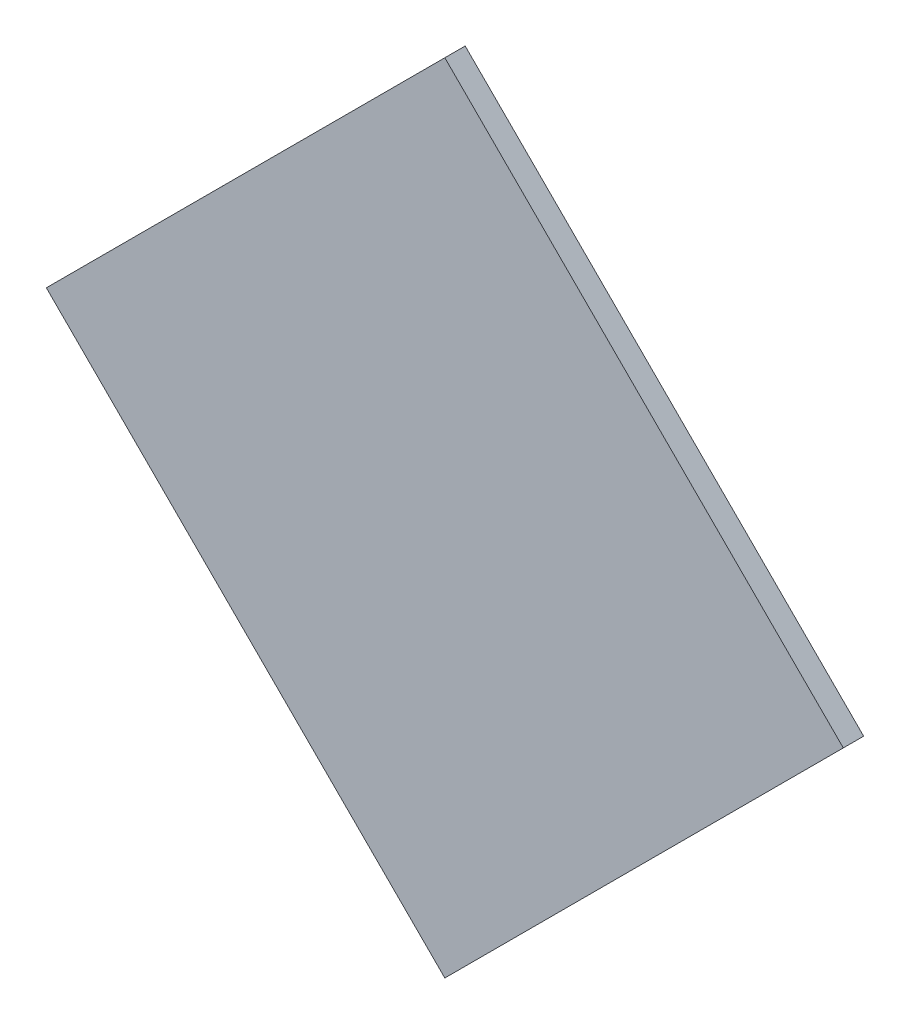
ISO-10303-21;
HEADER;
FILE_DESCRIPTION(('STEP AP214'),'2;1');
FILE_NAME('part.step','',(''),(''),'','','');
FILE_SCHEMA(('AUTOMOTIVE_DESIGN { 1 0 10303 214 1 1 1 1 }'));
ENDSEC;
DATA;
#1=APPLICATION_CONTEXT('core data for automotive mechanical design processes');
#2=APPLICATION_PROTOCOL_DEFINITION('international standard','automotive_design',2000,#1);
#3=PRODUCT_CONTEXT('',#1,'mechanical');
#4=PRODUCT('Part','Part','',(#3));
#5=PRODUCT_RELATED_PRODUCT_CATEGORY('part','',(#4));
#6=PRODUCT_DEFINITION_FORMATION('','',#4);
#7=PRODUCT_DEFINITION_CONTEXT('part definition',#1,'design');
#8=PRODUCT_DEFINITION('design','',#6,#7);
#9=PRODUCT_DEFINITION_SHAPE('','',#8);
#10=(LENGTH_UNIT() NAMED_UNIT(*) SI_UNIT(.MILLI.,.METRE.));
#11=(NAMED_UNIT(*) PLANE_ANGLE_UNIT() SI_UNIT($,.RADIAN.));
#12=(NAMED_UNIT(*) SI_UNIT($,.STERADIAN.) SOLID_ANGLE_UNIT());
#13=UNCERTAINTY_MEASURE_WITH_UNIT(LENGTH_MEASURE(1.E-05),#10,'distance_accuracy_value','');
#14=(GEOMETRIC_REPRESENTATION_CONTEXT(3) GLOBAL_UNCERTAINTY_ASSIGNED_CONTEXT((#13)) GLOBAL_UNIT_ASSIGNED_CONTEXT((#10,
#11,#12)) REPRESENTATION_CONTEXT('',''));
#15=CARTESIAN_POINT('',(0.,0.,0.));
#16=DIRECTION('',(0.,0.,1.));
#17=DIRECTION('',(1.,0.,0.));
#18=AXIS2_PLACEMENT_3D('',#15,#16,#17);
#19=CARTESIAN_POINT('',(3.337126416875,5.06167,0.76487));
#20=DIRECTION('',(0.,0.,-1.));
#21=DIRECTION('',(0.,1.,0.));
#22=AXIS2_PLACEMENT_3D('',#19,#20,#21);
#23=PLANE('',#22);
#24=DIRECTION('',(0.70710713223896,0.70710643013396,0.));
#25=VECTOR('',#24,1.);
#26=CARTESIAN_POINT('',(2.665374667,5.06167,0.76487));
#27=LINE('',#26,#25);
#28=CARTESIAN_POINT('',(2.665374667,5.06167,0.76487));
#29=VERTEX_POINT('',#28);
#30=CARTESIAN_POINT('',(3.337126667,5.733421333,0.76487));
#31=VERTEX_POINT('',#30);
#32=EDGE_CURVE('E55',#29,#31,#27,.T.);
#33=ORIENTED_EDGE('',*,*,#32,.T.);
#34=DIRECTION('',(0.707106781186548,-0.707106781186548,0.));
#35=VECTOR('',#34,1.);
#36=CARTESIAN_POINT('',(3.337126667,5.733421333,0.76487));
#37=LINE('',#36,#35);
#38=CARTESIAN_POINT('',(4.008878,5.06167,0.76487));
#39=VERTEX_POINT('',#38);
#40=EDGE_CURVE('E57',#31,#39,#37,.T.);
#41=ORIENTED_EDGE('',*,*,#40,.T.);
#42=DIRECTION('',(-0.707106781186548,-0.707106781186548,0.));
#43=VECTOR('',#42,1.);
#44=CARTESIAN_POINT('',(4.008878,5.06167,0.76487));
#45=LINE('',#44,#43);
#46=CARTESIAN_POINT('',(3.337126667,4.389918667,0.76487));
#47=VERTEX_POINT('',#46);
#48=EDGE_CURVE('E20',#39,#47,#45,.T.);
#49=ORIENTED_EDGE('',*,*,#48,.T.);
#50=DIRECTION('',(-0.70710713223896,0.70710643013396,0.));
#51=VECTOR('',#50,1.);
#52=CARTESIAN_POINT('',(3.337126667,4.389918667,0.76487));
#53=LINE('',#52,#51);
#54=EDGE_CURVE('E80',#47,#29,#53,.T.);
#55=ORIENTED_EDGE('',*,*,#54,.T.);
#56=EDGE_LOOP('',(#33,#41,#49,#55));
#57=FACE_BOUND('',#56,.T.);
#58=ADVANCED_FACE('F17',(#57),#23,.T.);
#59=CARTESIAN_POINT('',(4.008878,5.06167,0.76487));
#60=DIRECTION('',(-0.707106781186548,0.707106781186548,0.));
#61=DIRECTION('',(-0.707106781186548,-0.707106781186548,0.));
#62=AXIS2_PLACEMENT_3D('',#59,#60,#61);
#63=PLANE('',#62);
#64=DIRECTION('',(0.,0.,1.));
#65=VECTOR('',#64,1.);
#66=CARTESIAN_POINT('',(3.337126667,4.389918667,0.76487));
#67=LINE('',#66,#65);
#68=CARTESIAN_POINT('',(3.337126667,4.389918667,0.79916));
#69=VERTEX_POINT('',#68);
#70=EDGE_CURVE('E68',#69,#47,#67,.F.);
#71=ORIENTED_EDGE('',*,*,#70,.T.);
#72=ORIENTED_EDGE('',*,*,#48,.F.);
#73=DIRECTION('',(0.,0.,1.));
#74=VECTOR('',#73,1.);
#75=CARTESIAN_POINT('',(4.008878,5.06167,0.76487));
#76=LINE('',#75,#74);
#77=CARTESIAN_POINT('',(4.008878,5.06167,0.79916));
#78=VERTEX_POINT('',#77);
#79=EDGE_CURVE('E63',#39,#78,#76,.T.);
#80=ORIENTED_EDGE('',*,*,#79,.T.);
#81=DIRECTION('',(0.707106781186547,0.707106781186548,0.));
#82=VECTOR('',#81,1.);
#83=CARTESIAN_POINT('',(3.337126667,4.389918667,0.79916));
#84=LINE('',#83,#82);
#85=EDGE_CURVE('E83',#69,#78,#84,.T.);
#86=ORIENTED_EDGE('',*,*,#85,.F.);
#87=EDGE_LOOP('',(#71,#72,#80,#86));
#88=FACE_BOUND('',#87,.T.);
#89=ADVANCED_FACE('F65',(#88),#63,.F.);
#90=CARTESIAN_POINT('',(3.337126667,5.733421333,0.76487));
#91=DIRECTION('',(-0.707106781186548,-0.707106781186548,0.));
#92=DIRECTION('',(0.707106781186548,-0.707106781186548,0.));
#93=AXIS2_PLACEMENT_3D('',#90,#91,#92);
#94=PLANE('',#93);
#95=ORIENTED_EDGE('',*,*,#79,.F.);
#96=ORIENTED_EDGE('',*,*,#40,.F.);
#97=DIRECTION('',(0.,0.,1.));
#98=VECTOR('',#97,1.);
#99=CARTESIAN_POINT('',(3.33712666699999,5.73342133300001,0.76487));
#100=LINE('',#99,#98);
#101=CARTESIAN_POINT('',(3.337126667,5.733421333,0.79916));
#102=VERTEX_POINT('',#101);
#103=EDGE_CURVE('E75',#31,#102,#100,.T.);
#104=ORIENTED_EDGE('',*,*,#103,.T.);
#105=DIRECTION('',(-0.707106781186548,0.707106781186547,0.));
#106=VECTOR('',#105,1.);
#107=CARTESIAN_POINT('',(4.008878,5.06167,0.79916));
#108=LINE('',#107,#106);
#109=EDGE_CURVE('E72',#78,#102,#108,.T.);
#110=ORIENTED_EDGE('',*,*,#109,.F.);
#111=EDGE_LOOP('',(#95,#96,#104,#110));
#112=FACE_BOUND('',#111,.T.);
#113=ADVANCED_FACE('F70',(#112),#94,.F.);
#114=CARTESIAN_POINT('',(2.665374667,5.06167,0.76487));
#115=DIRECTION('',(0.70710643013396,-0.70710713223896,0.));
#116=DIRECTION('',(0.70710713223896,0.70710643013396,0.));
#117=AXIS2_PLACEMENT_3D('',#114,#115,#116);
#118=PLANE('',#117);
#119=ORIENTED_EDGE('',*,*,#103,.F.);
#120=ORIENTED_EDGE('',*,*,#32,.F.);
#121=DIRECTION('',(0.,0.,1.));
#122=VECTOR('',#121,1.);
#123=CARTESIAN_POINT('',(2.66537466700001,5.06167000000001,0.76487));
#124=LINE('',#123,#122);
#125=CARTESIAN_POINT('',(2.665374667,5.06167,0.79916));
#126=VERTEX_POINT('',#125);
#127=EDGE_CURVE('E35',#29,#126,#124,.T.);
#128=ORIENTED_EDGE('',*,*,#127,.T.);
#129=DIRECTION('',(-0.707107132238975,-0.707106430133946,0.));
#130=VECTOR('',#129,1.);
#131=CARTESIAN_POINT('',(3.337126667,5.733421333,0.79916));
#132=LINE('',#131,#130);
#133=EDGE_CURVE('E26',#102,#126,#132,.T.);
#134=ORIENTED_EDGE('',*,*,#133,.F.);
#135=EDGE_LOOP('',(#119,#120,#128,#134));
#136=FACE_BOUND('',#135,.T.);
#137=ADVANCED_FACE('F89',(#136),#118,.F.);
#138=CARTESIAN_POINT('',(3.337126667,4.389918667,0.76487));
#139=DIRECTION('',(0.70710643013396,0.70710713223896,0.));
#140=DIRECTION('',(-0.70710713223896,0.70710643013396,0.));
#141=AXIS2_PLACEMENT_3D('',#138,#139,#140);
#142=PLANE('',#141);
#143=ORIENTED_EDGE('',*,*,#127,.F.);
#144=ORIENTED_EDGE('',*,*,#54,.F.);
#145=ORIENTED_EDGE('',*,*,#70,.F.);
#146=DIRECTION('',(0.707107132238974,-0.707106430133947,0.));
#147=VECTOR('',#146,1.);
#148=CARTESIAN_POINT('',(2.665374667,5.06167,0.79916));
#149=LINE('',#148,#147);
#150=EDGE_CURVE('E11',#126,#69,#149,.T.);
#151=ORIENTED_EDGE('',*,*,#150,.F.);
#152=EDGE_LOOP('',(#143,#144,#145,#151));
#153=FACE_BOUND('',#152,.T.);
#154=ADVANCED_FACE('F91',(#153),#142,.F.);
#155=CARTESIAN_POINT('',(3.337126416875,5.06167,0.79916));
#156=DIRECTION('',(0.,0.,1.));
#157=DIRECTION('',(0.,-1.,0.));
#158=AXIS2_PLACEMENT_3D('',#155,#156,#157);
#159=PLANE('',#158);
#160=ORIENTED_EDGE('',*,*,#133,.T.);
#161=ORIENTED_EDGE('',*,*,#150,.T.);
#162=ORIENTED_EDGE('',*,*,#85,.T.);
#163=ORIENTED_EDGE('',*,*,#109,.T.);
#164=EDGE_LOOP('',(#160,#161,#162,#163));
#165=FACE_BOUND('',#164,.T.);
#166=ADVANCED_FACE('F88',(#165),#159,.T.);
#167=CLOSED_SHELL('',(#58,#89,#113,#137,#154,#166));
#168=MANIFOLD_SOLID_BREP('B1',#167);
#169=ADVANCED_BREP_SHAPE_REPRESENTATION('',(#18,#168),#14);
#170=SHAPE_DEFINITION_REPRESENTATION(#9,#169);
ENDSEC;
END-ISO-10303-21;
